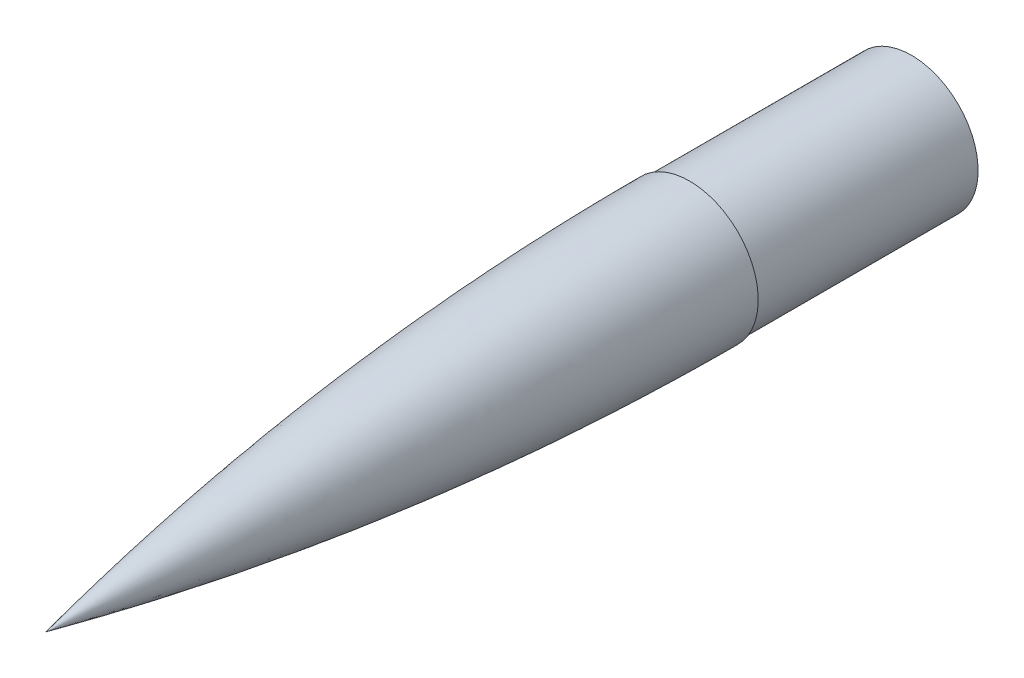
ISO-10303-21;
HEADER;
FILE_DESCRIPTION(('STEP AP214'),'2;1');
FILE_NAME('part.step','',(''),(''),'','','');
FILE_SCHEMA(('AUTOMOTIVE_DESIGN { 1 0 10303 214 1 1 1 1 }'));
ENDSEC;
DATA;
#1=APPLICATION_CONTEXT('core data for automotive mechanical design processes');
#2=APPLICATION_PROTOCOL_DEFINITION('international standard','automotive_design',2000,#1);
#3=PRODUCT_CONTEXT('',#1,'mechanical');
#4=PRODUCT('Part','Part','',(#3));
#5=PRODUCT_RELATED_PRODUCT_CATEGORY('part','',(#4));
#6=PRODUCT_DEFINITION_FORMATION('','',#4);
#7=PRODUCT_DEFINITION_CONTEXT('part definition',#1,'design');
#8=PRODUCT_DEFINITION('design','',#6,#7);
#9=PRODUCT_DEFINITION_SHAPE('','',#8);
#10=(LENGTH_UNIT() NAMED_UNIT(*) SI_UNIT(.MILLI.,.METRE.));
#11=(NAMED_UNIT(*) PLANE_ANGLE_UNIT() SI_UNIT($,.RADIAN.));
#12=(NAMED_UNIT(*) SI_UNIT($,.STERADIAN.) SOLID_ANGLE_UNIT());
#13=UNCERTAINTY_MEASURE_WITH_UNIT(LENGTH_MEASURE(1.E-05),#10,'distance_accuracy_value','');
#14=(GEOMETRIC_REPRESENTATION_CONTEXT(3) GLOBAL_UNCERTAINTY_ASSIGNED_CONTEXT((#13)) GLOBAL_UNIT_ASSIGNED_CONTEXT((#10,
#11,#12)) REPRESENTATION_CONTEXT('',''));
#15=CARTESIAN_POINT('',(0.,0.,0.));
#16=DIRECTION('',(0.,0.,1.));
#17=DIRECTION('',(1.,0.,0.));
#18=AXIS2_PLACEMENT_3D('',#15,#16,#17);
#19=CARTESIAN_POINT('',(0.,1708.08162913297,0.));
#20=DIRECTION('',(0.,0.,-1.));
#21=DIRECTION('',(-1.,0.,0.));
#22=AXIS2_PLACEMENT_3D('',#19,#20,#21);
#23=PLANE('',#22);
#24=CARTESIAN_POINT('',(0.,1708.08162913297,0.));
#25=DIRECTION('',(0.,0.,-1.));
#26=DIRECTION('',(-1.,0.,0.));
#27=AXIS2_PLACEMENT_3D('',#24,#25,#26);
#28=CIRCLE('',#27,38.1);
#29=CARTESIAN_POINT('',(-38.1,1708.08162913297,0.));
#30=VERTEX_POINT('',#29);
#31=EDGE_CURVE('E46',#30,#30,#28,.T.);
#32=ORIENTED_EDGE('',*,*,#31,.F.);
#33=EDGE_LOOP('',(#32));
#34=FACE_BOUND('',#33,.T.);
#35=CARTESIAN_POINT('',(0.,1708.08162913297,0.));
#36=DIRECTION('',(0.,0.,-1.));
#37=DIRECTION('',(-1.,0.,0.));
#38=AXIS2_PLACEMENT_3D('',#35,#36,#37);
#39=CIRCLE('',#38,39.2557);
#40=CARTESIAN_POINT('',(-39.2557,1708.08162913297,0.));
#41=VERTEX_POINT('',#40);
#42=EDGE_CURVE('E11',#41,#41,#39,.T.);
#43=ORIENTED_EDGE('',*,*,#42,.T.);
#44=EDGE_LOOP('',(#43));
#45=FACE_BOUND('',#44,.T.);
#46=ADVANCED_FACE('F39',(#34,#45),#23,.T.);
#47=CARTESIAN_POINT('',(1708.08162913297,1708.08162913297,0.));
#48=DIRECTION('',(0.,-1.,0.));
#49=DIRECTION('',(-1.,0.,0.));
#50=AXIS2_PLACEMENT_3D('',#47,#48,#49);
#51=CIRCLE('',#50,1747.33732913297);
#52=TRIMMED_CURVE('',#51,(PARAMETER_VALUE(-0.212370615201549)),
(PARAMETER_VALUE(0.212370615201549)),.T.,.PARAMETER.);
#53=CARTESIAN_POINT('',(0.,1708.08162913297,0.));
#54=DIRECTION('',(0.,0.,-1.));
#55=AXIS1_PLACEMENT('',#53,#54);
#56=SURFACE_OF_REVOLUTION('',#52,#55);
#57=CARTESIAN_POINT('',(0.,1708.08162913297,368.3));
#58=VERTEX_POINT('',#57);
#59=VERTEX_LOOP('',#58);
#60=FACE_BOUND('',#59,.T.);
#61=ORIENTED_EDGE('',*,*,#42,.F.);
#62=EDGE_LOOP('',(#61));
#63=FACE_BOUND('',#62,.T.);
#64=ADVANCED_FACE('F66',(#60,#63),#56,.T.);
#65=CARTESIAN_POINT('',(0.,1708.08162913297,-127.));
#66=DIRECTION('',(0.,0.,-1.));
#67=DIRECTION('',(-1.,0.,0.));
#68=AXIS2_PLACEMENT_3D('',#65,#66,#67);
#69=PLANE('',#68);
#70=CARTESIAN_POINT('',(0.,1708.08162913297,-127.));
#71=DIRECTION('',(0.,0.,-1.));
#72=DIRECTION('',(-1.,0.,0.));
#73=AXIS2_PLACEMENT_3D('',#70,#71,#72);
#74=CIRCLE('',#73,38.1);
#75=CARTESIAN_POINT('',(-38.1,1708.08162913297,-127.));
#76=VERTEX_POINT('',#75);
#77=EDGE_CURVE('E79',#76,#76,#74,.T.);
#78=ORIENTED_EDGE('',*,*,#77,.T.);
#79=EDGE_LOOP('',(#78));
#80=FACE_BOUND('',#79,.T.);
#81=CARTESIAN_POINT('',(0.,1708.08162913297,-127.));
#82=DIRECTION('',(0.,0.,-1.));
#83=DIRECTION('',(-1.,0.,0.));
#84=AXIS2_PLACEMENT_3D('',#81,#82,#83);
#85=CIRCLE('',#84,36.5125);
#86=CARTESIAN_POINT('',(-36.5125,1708.08162913297,-127.));
#87=VERTEX_POINT('',#86);
#88=EDGE_CURVE('E81',#87,#87,#85,.T.);
#89=ORIENTED_EDGE('',*,*,#88,.F.);
#90=EDGE_LOOP('',(#89));
#91=FACE_BOUND('',#90,.T.);
#92=ADVANCED_FACE('F72',(#80,#91),#69,.T.);
#93=CARTESIAN_POINT('',(0.,1708.08162913297,-127.));
#94=DIRECTION('',(0.,0.,1.));
#95=DIRECTION('',(1.,0.,0.));
#96=AXIS2_PLACEMENT_3D('',#93,#94,#95);
#97=CYLINDRICAL_SURFACE('',#96,38.1);
#98=ORIENTED_EDGE('',*,*,#77,.F.);
#99=EDGE_LOOP('',(#98));
#100=FACE_BOUND('',#99,.T.);
#101=ORIENTED_EDGE('',*,*,#31,.T.);
#102=EDGE_LOOP('',(#101));
#103=FACE_BOUND('',#102,.T.);
#104=ADVANCED_FACE('F60',(#100,#103),#97,.T.);
#105=CARTESIAN_POINT('',(0.,1708.08162913297,-127.));
#106=DIRECTION('',(0.,0.,1.));
#107=DIRECTION('',(1.,0.,0.));
#108=AXIS2_PLACEMENT_3D('',#105,#106,#107);
#109=CYLINDRICAL_SURFACE('',#108,36.5125);
#110=ORIENTED_EDGE('',*,*,#88,.T.);
#111=EDGE_LOOP('',(#110));
#112=FACE_BOUND('',#111,.T.);
#113=CARTESIAN_POINT('',(0.,1708.08162913297,74.4419674393918));
#114=DIRECTION('',(0.,0.,-1.));
#115=DIRECTION('',(-1.,0.,0.));
#116=AXIS2_PLACEMENT_3D('',#113,#114,#115);
#117=CIRCLE('',#116,36.5125);
#118=CARTESIAN_POINT('',(-36.5125,1708.08162913297,74.4419674393918));
#119=VERTEX_POINT('',#118);
#120=EDGE_CURVE('E84',#119,#119,#117,.T.);
#121=ORIENTED_EDGE('',*,*,#120,.F.);
#122=EDGE_LOOP('',(#121));
#123=FACE_BOUND('',#122,.T.);
#124=ADVANCED_FACE('F54',(#112,#123),#109,.F.);
#125=CARTESIAN_POINT('',(1708.08162913297,1708.08162913297,0.));
#126=DIRECTION('',(0.,-1.,0.));
#127=DIRECTION('',(-1.,0.,0.));
#128=AXIS2_PLACEMENT_3D('',#125,#126,#127);
#129=CIRCLE('',#128,1746.18162913297);
#130=TRIMMED_CURVE('',#129,(PARAMETER_VALUE(-0.20927898164568)),
(PARAMETER_VALUE(0.20927898164568)),.T.,.PARAMETER.);
#131=CARTESIAN_POINT('',(0.,1708.08162913297,0.));
#132=DIRECTION('',(0.,0.,-1.));
#133=AXIS1_PLACEMENT('',#131,#132);
#134=SURFACE_OF_REVOLUTION('',#130,#133);
#135=ORIENTED_EDGE('',*,*,#120,.T.);
#136=EDGE_LOOP('',(#135));
#137=FACE_BOUND('',#136,.T.);
#138=CARTESIAN_POINT('',(0.,1708.08162913297,362.777383721659));
#139=VERTEX_POINT('',#138);
#140=VERTEX_LOOP('',#139);
#141=FACE_BOUND('',#140,.T.);
#142=ADVANCED_FACE('F52',(#137,#141),#134,.F.);
#143=CLOSED_SHELL('',(#46,#64,#92,#104,#124,#142));
#144=MANIFOLD_SOLID_BREP('B2',#143);
#145=ADVANCED_BREP_SHAPE_REPRESENTATION('',(#18,#144),#14);
#146=SHAPE_DEFINITION_REPRESENTATION(#9,#145);
ENDSEC;
END-ISO-10303-21;
